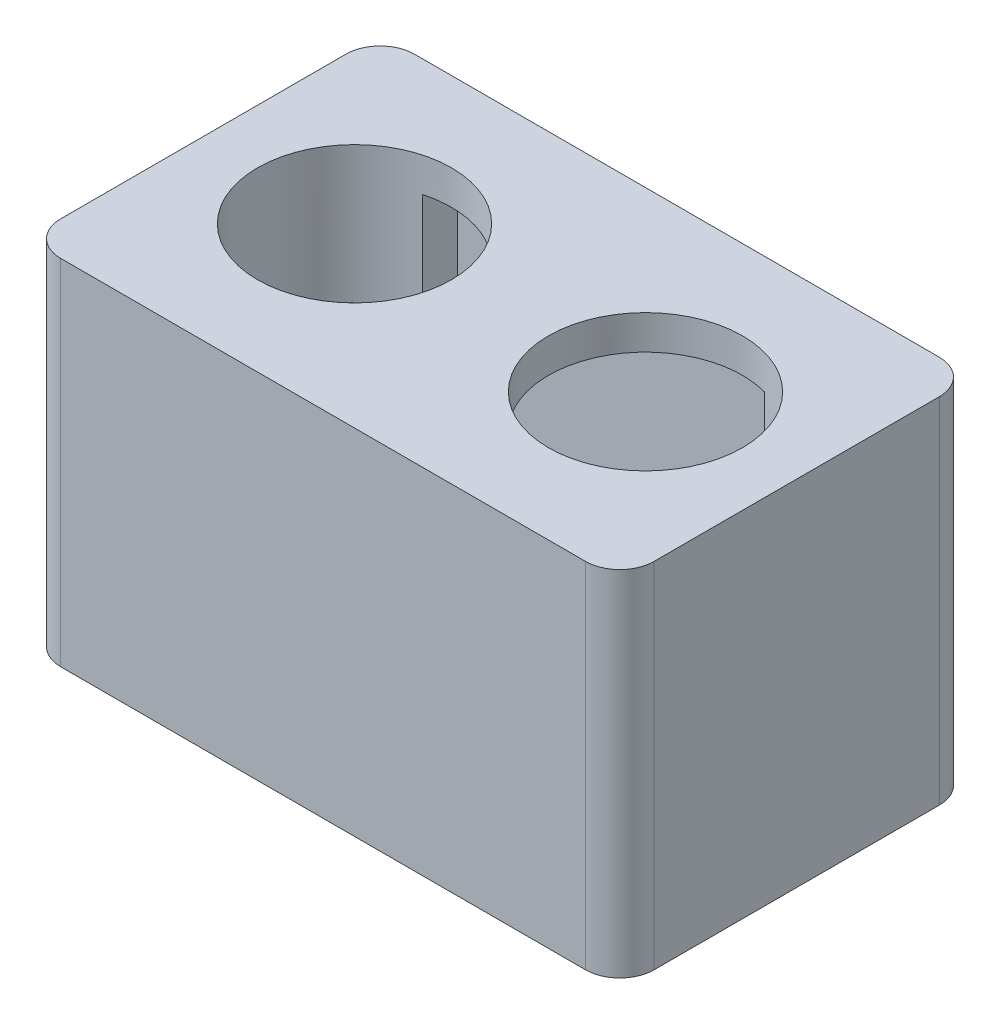
ISO-10303-21;
HEADER;
FILE_DESCRIPTION(('STEP AP214'),'2;1');
FILE_NAME('part.step','',(''),(''),'','','');
FILE_SCHEMA(('AUTOMOTIVE_DESIGN { 1 0 10303 214 1 1 1 1 }'));
ENDSEC;
DATA;
#1=APPLICATION_CONTEXT('core data for automotive mechanical design processes');
#2=APPLICATION_PROTOCOL_DEFINITION('international standard','automotive_design',2000,#1);
#3=PRODUCT_CONTEXT('',#1,'mechanical');
#4=PRODUCT('Part','Part','',(#3));
#5=PRODUCT_RELATED_PRODUCT_CATEGORY('part','',(#4));
#6=PRODUCT_DEFINITION_FORMATION('','',#4);
#7=PRODUCT_DEFINITION_CONTEXT('part definition',#1,'design');
#8=PRODUCT_DEFINITION('design','',#6,#7);
#9=PRODUCT_DEFINITION_SHAPE('','',#8);
#10=(LENGTH_UNIT() NAMED_UNIT(*) SI_UNIT(.MILLI.,.METRE.));
#11=(NAMED_UNIT(*) PLANE_ANGLE_UNIT() SI_UNIT($,.RADIAN.));
#12=(NAMED_UNIT(*) SI_UNIT($,.STERADIAN.) SOLID_ANGLE_UNIT());
#13=UNCERTAINTY_MEASURE_WITH_UNIT(LENGTH_MEASURE(1.E-05),#10,'distance_accuracy_value','');
#14=(GEOMETRIC_REPRESENTATION_CONTEXT(3) GLOBAL_UNCERTAINTY_ASSIGNED_CONTEXT((#13)) GLOBAL_UNIT_ASSIGNED_CONTEXT((#10,
#11,#12)) REPRESENTATION_CONTEXT('',''));
#15=CARTESIAN_POINT('',(0.,0.,0.));
#16=DIRECTION('',(0.,0.,1.));
#17=DIRECTION('',(1.,0.,0.));
#18=AXIS2_PLACEMENT_3D('',#15,#16,#17);
#19=CARTESIAN_POINT('',(12.75,0.,0.));
#20=DIRECTION('',(0.,1.,0.));
#21=DIRECTION('',(0.,0.,1.));
#22=AXIS2_PLACEMENT_3D('',#19,#20,#21);
#23=CYLINDRICAL_SURFACE('',#22,11.5);
#24=DIRECTION('',(0.,1.,0.));
#25=VECTOR('',#24,1.);
#26=CARTESIAN_POINT('',(15.,0.,11.27774356864));
#27=LINE('',#26,#25);
#28=CARTESIAN_POINT('',(15.,19.,11.27774356864));
#29=VERTEX_POINT('',#28);
#30=CARTESIAN_POINT('',(15.,28.,11.27774356864));
#31=VERTEX_POINT('',#30);
#32=EDGE_CURVE('E297',#29,#31,#27,.T.);
#33=ORIENTED_EDGE('',*,*,#32,.F.);
#34=CARTESIAN_POINT('',(12.75,19.,0.));
#35=DIRECTION('',(0.,-1.,0.));
#36=DIRECTION('',(0.,0.,-1.));
#37=AXIS2_PLACEMENT_3D('',#34,#35,#36);
#38=CIRCLE('',#37,11.5);
#39=CARTESIAN_POINT('',(23.,19.,5.21416340365354));
#40=VERTEX_POINT('',#39);
#41=EDGE_CURVE('E530',#29,#40,#38,.F.);
#42=ORIENTED_EDGE('',*,*,#41,.T.);
#43=DIRECTION('',(0.,1.,0.));
#44=VECTOR('',#43,1.);
#45=CARTESIAN_POINT('',(23.,0.,5.21416340365354));
#46=LINE('',#45,#44);
#47=CARTESIAN_POINT('',(23.,28.,5.21416340365354));
#48=VERTEX_POINT('',#47);
#49=EDGE_CURVE('E329',#48,#40,#46,.F.);
#50=ORIENTED_EDGE('',*,*,#49,.F.);
#51=CARTESIAN_POINT('',(12.75,28.,0.));
#52=DIRECTION('',(0.,1.,0.));
#53=DIRECTION('',(0.,0.,1.));
#54=AXIS2_PLACEMENT_3D('',#51,#52,#53);
#55=CIRCLE('',#54,11.5);
#56=EDGE_CURVE('E306',#31,#48,#55,.T.);
#57=ORIENTED_EDGE('',*,*,#56,.F.);
#58=EDGE_LOOP('',(#33,#42,#50,#57));
#59=FACE_BOUND('',#58,.T.);
#60=ADVANCED_FACE('F112',(#59),#23,.T.);
#61=CARTESIAN_POINT('',(-12.75,0.,0.));
#62=DIRECTION('',(0.,1.,0.));
#63=DIRECTION('',(0.,0.,1.));
#64=AXIS2_PLACEMENT_3D('',#61,#62,#63);
#65=CYLINDRICAL_SURFACE('',#64,11.5);
#66=DIRECTION('',(0.,1.,0.));
#67=VECTOR('',#66,1.);
#68=CARTESIAN_POINT('',(-15.,0.,11.27774356864));
#69=LINE('',#68,#67);
#70=CARTESIAN_POINT('',(-15.,28.,11.27774356864));
#71=VERTEX_POINT('',#70);
#72=CARTESIAN_POINT('',(-15.,19.,11.27774356864));
#73=VERTEX_POINT('',#72);
#74=EDGE_CURVE('E458',#71,#73,#69,.F.);
#75=ORIENTED_EDGE('',*,*,#74,.F.);
#76=CARTESIAN_POINT('',(-12.75,28.,0.));
#77=DIRECTION('',(0.,1.,0.));
#78=DIRECTION('',(0.,0.,1.));
#79=AXIS2_PLACEMENT_3D('',#76,#77,#78);
#80=CIRCLE('',#79,11.5);
#81=CARTESIAN_POINT('',(-23.,28.,5.21416340365354));
#82=VERTEX_POINT('',#81);
#83=EDGE_CURVE('E310',#82,#71,#80,.T.);
#84=ORIENTED_EDGE('',*,*,#83,.F.);
#85=DIRECTION('',(0.,1.,0.));
#86=VECTOR('',#85,1.);
#87=CARTESIAN_POINT('',(-23.,0.,5.21416340365354));
#88=LINE('',#87,#86);
#89=CARTESIAN_POINT('',(-23.,19.,5.21416340365354));
#90=VERTEX_POINT('',#89);
#91=EDGE_CURVE('E337',#90,#82,#88,.T.);
#92=ORIENTED_EDGE('',*,*,#91,.F.);
#93=CARTESIAN_POINT('',(-12.75,19.,0.));
#94=DIRECTION('',(0.,-1.,0.));
#95=DIRECTION('',(0.,0.,-1.));
#96=AXIS2_PLACEMENT_3D('',#93,#94,#95);
#97=CIRCLE('',#96,11.5);
#98=EDGE_CURVE('E437',#90,#73,#97,.F.);
#99=ORIENTED_EDGE('',*,*,#98,.T.);
#100=EDGE_LOOP('',(#75,#84,#92,#99));
#101=FACE_BOUND('',#100,.T.);
#102=ADVANCED_FACE('F506',(#101),#65,.T.);
#103=CARTESIAN_POINT('',(12.75,0.,0.));
#104=DIRECTION('',(0.,1.,0.));
#105=DIRECTION('',(0.,0.,1.));
#106=AXIS2_PLACEMENT_3D('',#103,#104,#105);
#107=CYLINDRICAL_SURFACE('',#106,8.5);
#108=CARTESIAN_POINT('',(12.75,31.,0.));
#109=DIRECTION('',(0.,1.,0.));
#110=DIRECTION('',(0.,0.,1.));
#111=AXIS2_PLACEMENT_3D('',#108,#109,#110);
#112=CIRCLE('',#111,8.5);
#113=CARTESIAN_POINT('',(12.75,31.,8.5));
#114=VERTEX_POINT('',#113);
#115=EDGE_CURVE('E344',#114,#114,#112,.T.);
#116=ORIENTED_EDGE('',*,*,#115,.T.);
#117=EDGE_LOOP('',(#116));
#118=FACE_BOUND('',#117,.T.);
#119=CARTESIAN_POINT('',(12.75,28.,0.));
#120=DIRECTION('',(0.,1.,0.));
#121=DIRECTION('',(0.,0.,1.));
#122=AXIS2_PLACEMENT_3D('',#119,#120,#121);
#123=CIRCLE('',#122,8.5);
#124=CARTESIAN_POINT('',(15.,28.,8.1967981553775));
#125=VERTEX_POINT('',#124);
#126=CARTESIAN_POINT('',(15.,28.,-8.1967981553775));
#127=VERTEX_POINT('',#126);
#128=EDGE_CURVE('E521',#125,#127,#123,.F.);
#129=ORIENTED_EDGE('',*,*,#128,.T.);
#130=DIRECTION('',(0.,1.,0.));
#131=VECTOR('',#130,1.);
#132=CARTESIAN_POINT('',(15.,0.,-8.1967981553775));
#133=LINE('',#132,#131);
#134=CARTESIAN_POINT('',(15.,19.,-8.1967981553775));
#135=VERTEX_POINT('',#134);
#136=EDGE_CURVE('E280',#127,#135,#133,.F.);
#137=ORIENTED_EDGE('',*,*,#136,.T.);
#138=CARTESIAN_POINT('',(12.75,19.,0.));
#139=DIRECTION('',(0.,-1.,0.));
#140=DIRECTION('',(0.,0.,-1.));
#141=AXIS2_PLACEMENT_3D('',#138,#139,#140);
#142=CIRCLE('',#141,8.5);
#143=CARTESIAN_POINT('',(15.,19.,8.1967981553775));
#144=VERTEX_POINT('',#143);
#145=EDGE_CURVE('E312',#144,#135,#142,.F.);
#146=ORIENTED_EDGE('',*,*,#145,.F.);
#147=DIRECTION('',(0.,1.,0.));
#148=VECTOR('',#147,1.);
#149=CARTESIAN_POINT('',(15.,0.,8.1967981553775));
#150=LINE('',#149,#148);
#151=EDGE_CURVE('E136',#144,#125,#150,.T.);
#152=ORIENTED_EDGE('',*,*,#151,.T.);
#153=EDGE_LOOP('',(#129,#137,#146,#152));
#154=FACE_BOUND('',#153,.T.);
#155=ADVANCED_FACE('F543',(#118,#154),#107,.F.);
#156=CARTESIAN_POINT('',(-12.75,0.,0.));
#157=DIRECTION('',(0.,1.,0.));
#158=DIRECTION('',(0.,0.,1.));
#159=AXIS2_PLACEMENT_3D('',#156,#157,#158);
#160=CYLINDRICAL_SURFACE('',#159,8.5);
#161=CARTESIAN_POINT('',(-12.75,31.,0.));
#162=DIRECTION('',(0.,1.,0.));
#163=DIRECTION('',(0.,0.,1.));
#164=AXIS2_PLACEMENT_3D('',#161,#162,#163);
#165=CIRCLE('',#164,8.5);
#166=CARTESIAN_POINT('',(-12.75,31.,8.5));
#167=VERTEX_POINT('',#166);
#168=EDGE_CURVE('E345',#167,#167,#165,.T.);
#169=ORIENTED_EDGE('',*,*,#168,.T.);
#170=EDGE_LOOP('',(#169));
#171=FACE_BOUND('',#170,.T.);
#172=CARTESIAN_POINT('',(-12.75,28.,0.));
#173=DIRECTION('',(0.,1.,0.));
#174=DIRECTION('',(0.,0.,1.));
#175=AXIS2_PLACEMENT_3D('',#172,#173,#174);
#176=CIRCLE('',#175,8.5);
#177=CARTESIAN_POINT('',(-15.,28.,-8.1967981553775));
#178=VERTEX_POINT('',#177);
#179=CARTESIAN_POINT('',(-15.,28.,8.1967981553775));
#180=VERTEX_POINT('',#179);
#181=EDGE_CURVE('E518',#178,#180,#176,.F.);
#182=ORIENTED_EDGE('',*,*,#181,.T.);
#183=DIRECTION('',(0.,1.,0.));
#184=VECTOR('',#183,1.);
#185=CARTESIAN_POINT('',(-15.,0.,8.1967981553775));
#186=LINE('',#185,#184);
#187=CARTESIAN_POINT('',(-15.,19.,8.1967981553775));
#188=VERTEX_POINT('',#187);
#189=EDGE_CURVE('E511',#180,#188,#186,.F.);
#190=ORIENTED_EDGE('',*,*,#189,.T.);
#191=CARTESIAN_POINT('',(-12.75,19.,0.));
#192=DIRECTION('',(0.,-1.,0.));
#193=DIRECTION('',(0.,0.,-1.));
#194=AXIS2_PLACEMENT_3D('',#191,#192,#193);
#195=CIRCLE('',#194,8.5);
#196=CARTESIAN_POINT('',(-15.,19.,-8.1967981553775));
#197=VERTEX_POINT('',#196);
#198=EDGE_CURVE('E533',#197,#188,#195,.F.);
#199=ORIENTED_EDGE('',*,*,#198,.F.);
#200=DIRECTION('',(0.,1.,0.));
#201=VECTOR('',#200,1.);
#202=CARTESIAN_POINT('',(-15.,0.,-8.1967981553775));
#203=LINE('',#202,#201);
#204=EDGE_CURVE('E128',#197,#178,#203,.T.);
#205=ORIENTED_EDGE('',*,*,#204,.T.);
#206=EDGE_LOOP('',(#182,#190,#199,#205));
#207=FACE_BOUND('',#206,.T.);
#208=ADVANCED_FACE('F556',(#171,#207),#160,.F.);
#209=DIRECTION('',(0.,1.,0.));
#210=VECTOR('',#209,1.);
#211=CARTESIAN_POINT('',(15.,0.,-11.27774356864));
#212=LINE('',#211,#210);
#213=CARTESIAN_POINT('',(15.,28.,-11.27774356864));
#214=VERTEX_POINT('',#213);
#215=CARTESIAN_POINT('',(15.,19.,-11.27774356864));
#216=VERTEX_POINT('',#215);
#217=EDGE_CURVE('E277',#214,#216,#212,.F.);
#218=ORIENTED_EDGE('',*,*,#217,.F.);
#219=CARTESIAN_POINT('',(23.,28.,-5.21416340365354));
#220=VERTEX_POINT('',#219);
#221=EDGE_CURVE('E293',#220,#214,#55,.T.);
#222=ORIENTED_EDGE('',*,*,#221,.F.);
#223=DIRECTION('',(0.,1.,0.));
#224=VECTOR('',#223,1.);
#225=CARTESIAN_POINT('',(23.,0.,-5.21416340365354));
#226=LINE('',#225,#224);
#227=CARTESIAN_POINT('',(23.,19.,-5.21416340365354));
#228=VERTEX_POINT('',#227);
#229=EDGE_CURVE('E333',#220,#228,#226,.F.);
#230=ORIENTED_EDGE('',*,*,#229,.T.);
#231=EDGE_CURVE('E295',#228,#216,#38,.F.);
#232=ORIENTED_EDGE('',*,*,#231,.T.);
#233=EDGE_LOOP('',(#218,#222,#230,#232));
#234=FACE_BOUND('',#233,.T.);
#235=ADVANCED_FACE('F291',(#234),#23,.T.);
#236=DIRECTION('',(0.,1.,0.));
#237=VECTOR('',#236,1.);
#238=CARTESIAN_POINT('',(-15.,0.,-11.27774356864));
#239=LINE('',#238,#237);
#240=CARTESIAN_POINT('',(-15.,19.,-11.27774356864));
#241=VERTEX_POINT('',#240);
#242=CARTESIAN_POINT('',(-15.,28.,-11.27774356864));
#243=VERTEX_POINT('',#242);
#244=EDGE_CURVE('E448',#241,#243,#239,.T.);
#245=ORIENTED_EDGE('',*,*,#244,.F.);
#246=CARTESIAN_POINT('',(-23.,19.,-5.21416340365354));
#247=VERTEX_POINT('',#246);
#248=EDGE_CURVE('E436',#241,#247,#97,.F.);
#249=ORIENTED_EDGE('',*,*,#248,.T.);
#250=DIRECTION('',(0.,1.,0.));
#251=VECTOR('',#250,1.);
#252=CARTESIAN_POINT('',(-23.,0.,-5.21416340365354));
#253=LINE('',#252,#251);
#254=CARTESIAN_POINT('',(-23.,28.,-5.21416340365354));
#255=VERTEX_POINT('',#254);
#256=EDGE_CURVE('E340',#247,#255,#253,.T.);
#257=ORIENTED_EDGE('',*,*,#256,.T.);
#258=EDGE_CURVE('E305',#243,#255,#80,.T.);
#259=ORIENTED_EDGE('',*,*,#258,.F.);
#260=EDGE_LOOP('',(#245,#249,#257,#259));
#261=FACE_BOUND('',#260,.T.);
#262=ADVANCED_FACE('F455',(#261),#65,.T.);
#263=CARTESIAN_POINT('',(0.,0.,0.));
#264=DIRECTION('',(0.,1.,0.));
#265=DIRECTION('',(0.,0.,1.));
#266=AXIS2_PLACEMENT_3D('',#263,#264,#265);
#267=PLANE('',#266);
#268=DIRECTION('',(1.,0.,0.));
#269=VECTOR('',#268,1.);
#270=CARTESIAN_POINT('',(0.,0.,12.5));
#271=LINE('',#270,#269);
#272=CARTESIAN_POINT('',(-23.,0.,12.5));
#273=VERTEX_POINT('',#272);
#274=CARTESIAN_POINT('',(23.,0.,12.5));
#275=VERTEX_POINT('',#274);
#276=EDGE_CURVE('E323',#273,#275,#271,.T.);
#277=ORIENTED_EDGE('',*,*,#276,.T.);
#278=DIRECTION('',(0.,0.,1.));
#279=VECTOR('',#278,1.);
#280=CARTESIAN_POINT('',(23.,0.,0.));
#281=LINE('',#280,#279);
#282=CARTESIAN_POINT('',(23.,0.,-12.5));
#283=VERTEX_POINT('',#282);
#284=EDGE_CURVE('E320',#283,#275,#281,.T.);
#285=ORIENTED_EDGE('',*,*,#284,.F.);
#286=DIRECTION('',(1.,0.,0.));
#287=VECTOR('',#286,1.);
#288=CARTESIAN_POINT('',(0.,0.,-12.5));
#289=LINE('',#288,#287);
#290=CARTESIAN_POINT('',(-23.,0.,-12.5));
#291=VERTEX_POINT('',#290);
#292=EDGE_CURVE('E315',#291,#283,#289,.T.);
#293=ORIENTED_EDGE('',*,*,#292,.F.);
#294=DIRECTION('',(0.,0.,1.));
#295=VECTOR('',#294,1.);
#296=CARTESIAN_POINT('',(-23.,0.,0.));
#297=LINE('',#296,#295);
#298=EDGE_CURVE('E319',#291,#273,#297,.T.);
#299=ORIENTED_EDGE('',*,*,#298,.T.);
#300=EDGE_LOOP('',(#277,#285,#293,#299));
#301=FACE_BOUND('',#300,.T.);
#302=DIRECTION('',(1.,0.,0.));
#303=VECTOR('',#302,1.);
#304=CARTESIAN_POINT('',(0.,0.,15.5));
#305=LINE('',#304,#303);
#306=CARTESIAN_POINT('',(-23.,0.,15.5));
#307=VERTEX_POINT('',#306);
#308=CARTESIAN_POINT('',(23.,0.,15.5));
#309=VERTEX_POINT('',#308);
#310=EDGE_CURVE('E358',#307,#309,#305,.T.);
#311=ORIENTED_EDGE('',*,*,#310,.F.);
#312=CARTESIAN_POINT('',(-23.,0.,12.5));
#313=DIRECTION('',(0.,1.,0.));
#314=DIRECTION('',(0.,0.,1.));
#315=AXIS2_PLACEMENT_3D('',#312,#313,#314);
#316=CIRCLE('',#315,3.);
#317=CARTESIAN_POINT('',(-26.,0.,12.5));
#318=VERTEX_POINT('',#317);
#319=EDGE_CURVE('E400',#307,#318,#316,.F.);
#320=ORIENTED_EDGE('',*,*,#319,.T.);
#321=DIRECTION('',(0.,0.,1.));
#322=VECTOR('',#321,1.);
#323=CARTESIAN_POINT('',(-26.,0.,0.));
#324=LINE('',#323,#322);
#325=CARTESIAN_POINT('',(-26.,0.,-12.5));
#326=VERTEX_POINT('',#325);
#327=EDGE_CURVE('E378',#326,#318,#324,.T.);
#328=ORIENTED_EDGE('',*,*,#327,.F.);
#329=CARTESIAN_POINT('',(-23.,0.,-12.5));
#330=DIRECTION('',(0.,1.,0.));
#331=DIRECTION('',(0.,0.,1.));
#332=AXIS2_PLACEMENT_3D('',#329,#330,#331);
#333=CIRCLE('',#332,3.);
#334=CARTESIAN_POINT('',(-23.,0.,-15.5));
#335=VERTEX_POINT('',#334);
#336=EDGE_CURVE('E397',#326,#335,#333,.F.);
#337=ORIENTED_EDGE('',*,*,#336,.T.);
#338=DIRECTION('',(1.,0.,0.));
#339=VECTOR('',#338,1.);
#340=CARTESIAN_POINT('',(0.,0.,-15.5));
#341=LINE('',#340,#339);
#342=CARTESIAN_POINT('',(23.,0.,-15.5));
#343=VERTEX_POINT('',#342);
#344=EDGE_CURVE('E374',#335,#343,#341,.T.);
#345=ORIENTED_EDGE('',*,*,#344,.T.);
#346=CARTESIAN_POINT('',(23.,0.,-12.5));
#347=DIRECTION('',(0.,1.,0.));
#348=DIRECTION('',(0.,0.,1.));
#349=AXIS2_PLACEMENT_3D('',#346,#347,#348);
#350=CIRCLE('',#349,3.);
#351=CARTESIAN_POINT('',(26.,0.,-12.5));
#352=VERTEX_POINT('',#351);
#353=EDGE_CURVE('E391',#343,#352,#350,.F.);
#354=ORIENTED_EDGE('',*,*,#353,.T.);
#355=DIRECTION('',(0.,0.,1.));
#356=VECTOR('',#355,1.);
#357=CARTESIAN_POINT('',(26.,0.,0.));
#358=LINE('',#357,#356);
#359=CARTESIAN_POINT('',(26.,0.,12.5));
#360=VERTEX_POINT('',#359);
#361=EDGE_CURVE('E349',#352,#360,#358,.T.);
#362=ORIENTED_EDGE('',*,*,#361,.T.);
#363=CARTESIAN_POINT('',(23.,0.,12.5));
#364=DIRECTION('',(0.,1.,0.));
#365=DIRECTION('',(0.,0.,1.));
#366=AXIS2_PLACEMENT_3D('',#363,#364,#365);
#367=CIRCLE('',#366,3.);
#368=EDGE_CURVE('E394',#360,#309,#367,.F.);
#369=ORIENTED_EDGE('',*,*,#368,.T.);
#370=EDGE_LOOP('',(#311,#320,#328,#337,#345,#354,#362,#369));
#371=FACE_BOUND('',#370,.T.);
#372=ADVANCED_FACE('F579',(#301,#371),#267,.F.);
#373=CARTESIAN_POINT('',(0.,31.,-15.5));
#374=DIRECTION('',(0.,0.,-1.));
#375=DIRECTION('',(-1.,0.,0.));
#376=AXIS2_PLACEMENT_3D('',#373,#374,#375);
#377=PLANE('',#376);
#378=ORIENTED_EDGE('',*,*,#344,.F.);
#379=DIRECTION('',(0.,-1.,0.));
#380=VECTOR('',#379,1.);
#381=CARTESIAN_POINT('',(-23.,31.,-15.5));
#382=LINE('',#381,#380);
#383=CARTESIAN_POINT('',(-23.,31.,-15.5));
#384=VERTEX_POINT('',#383);
#385=EDGE_CURVE('E426',#335,#384,#382,.F.);
#386=ORIENTED_EDGE('',*,*,#385,.T.);
#387=DIRECTION('',(1.,0.,0.));
#388=VECTOR('',#387,1.);
#389=CARTESIAN_POINT('',(0.,31.,-15.5));
#390=LINE('',#389,#388);
#391=CARTESIAN_POINT('',(23.,31.,-15.5));
#392=VERTEX_POINT('',#391);
#393=EDGE_CURVE('E357',#384,#392,#390,.T.);
#394=ORIENTED_EDGE('',*,*,#393,.T.);
#395=DIRECTION('',(0.,-1.,0.));
#396=VECTOR('',#395,1.);
#397=CARTESIAN_POINT('',(23.,31.,-15.5));
#398=LINE('',#397,#396);
#399=EDGE_CURVE('E422',#392,#343,#398,.T.);
#400=ORIENTED_EDGE('',*,*,#399,.T.);
#401=EDGE_LOOP('',(#378,#386,#394,#400));
#402=FACE_BOUND('',#401,.T.);
#403=ADVANCED_FACE('F596',(#402),#377,.T.);
#404=CARTESIAN_POINT('',(-26.,31.,0.));
#405=DIRECTION('',(1.,0.,0.));
#406=DIRECTION('',(0.,0.,-1.));
#407=AXIS2_PLACEMENT_3D('',#404,#405,#406);
#408=PLANE('',#407);
#409=ORIENTED_EDGE('',*,*,#327,.T.);
#410=DIRECTION('',(0.,-1.,0.));
#411=VECTOR('',#410,1.);
#412=CARTESIAN_POINT('',(-26.,31.,12.5));
#413=LINE('',#412,#411);
#414=CARTESIAN_POINT('',(-26.,31.,12.5));
#415=VERTEX_POINT('',#414);
#416=EDGE_CURVE('E407',#318,#415,#413,.F.);
#417=ORIENTED_EDGE('',*,*,#416,.T.);
#418=DIRECTION('',(0.,0.,1.));
#419=VECTOR('',#418,1.);
#420=CARTESIAN_POINT('',(-26.,31.,0.));
#421=LINE('',#420,#419);
#422=CARTESIAN_POINT('',(-26.,31.,-12.5));
#423=VERTEX_POINT('',#422);
#424=EDGE_CURVE('E362',#423,#415,#421,.T.);
#425=ORIENTED_EDGE('',*,*,#424,.F.);
#426=DIRECTION('',(0.,-1.,0.));
#427=VECTOR('',#426,1.);
#428=CARTESIAN_POINT('',(-26.,0.,-12.5));
#429=LINE('',#428,#427);
#430=EDGE_CURVE('E403',#423,#326,#429,.T.);
#431=ORIENTED_EDGE('',*,*,#430,.T.);
#432=EDGE_LOOP('',(#409,#417,#425,#431));
#433=FACE_BOUND('',#432,.T.);
#434=ADVANCED_FACE('F601',(#433),#408,.F.);
#435=CARTESIAN_POINT('',(0.,31.,15.5));
#436=DIRECTION('',(0.,0.,-1.));
#437=DIRECTION('',(-1.,0.,0.));
#438=AXIS2_PLACEMENT_3D('',#435,#436,#437);
#439=PLANE('',#438);
#440=DIRECTION('',(1.,0.,0.));
#441=VECTOR('',#440,1.);
#442=CARTESIAN_POINT('',(0.,31.,15.5));
#443=LINE('',#442,#441);
#444=CARTESIAN_POINT('',(-23.,31.,15.5));
#445=VERTEX_POINT('',#444);
#446=CARTESIAN_POINT('',(23.,31.,15.5));
#447=VERTEX_POINT('',#446);
#448=EDGE_CURVE('E366',#445,#447,#443,.T.);
#449=ORIENTED_EDGE('',*,*,#448,.F.);
#450=DIRECTION('',(0.,-1.,0.));
#451=VECTOR('',#450,1.);
#452=CARTESIAN_POINT('',(-23.,31.,15.5));
#453=LINE('',#452,#451);
#454=EDGE_CURVE('E387',#445,#307,#453,.T.);
#455=ORIENTED_EDGE('',*,*,#454,.T.);
#456=ORIENTED_EDGE('',*,*,#310,.T.);
#457=DIRECTION('',(0.,-1.,0.));
#458=VECTOR('',#457,1.);
#459=CARTESIAN_POINT('',(23.,31.,15.5));
#460=LINE('',#459,#458);
#461=EDGE_CURVE('E370',#309,#447,#460,.F.);
#462=ORIENTED_EDGE('',*,*,#461,.T.);
#463=EDGE_LOOP('',(#449,#455,#456,#462));
#464=FACE_BOUND('',#463,.T.);
#465=ADVANCED_FACE('F598',(#464),#439,.F.);
#466=CARTESIAN_POINT('',(26.,31.,0.));
#467=DIRECTION('',(1.,0.,0.));
#468=DIRECTION('',(0.,0.,-1.));
#469=AXIS2_PLACEMENT_3D('',#466,#467,#468);
#470=PLANE('',#469);
#471=DIRECTION('',(0.,0.,1.));
#472=VECTOR('',#471,1.);
#473=CARTESIAN_POINT('',(26.,31.,0.));
#474=LINE('',#473,#472);
#475=CARTESIAN_POINT('',(26.,31.,-12.5));
#476=VERTEX_POINT('',#475);
#477=CARTESIAN_POINT('',(26.,31.,12.5));
#478=VERTEX_POINT('',#477);
#479=EDGE_CURVE('E353',#476,#478,#474,.T.);
#480=ORIENTED_EDGE('',*,*,#479,.T.);
#481=DIRECTION('',(0.,-1.,0.));
#482=VECTOR('',#481,1.);
#483=CARTESIAN_POINT('',(26.,0.,12.5));
#484=LINE('',#483,#482);
#485=EDGE_CURVE('E432',#478,#360,#484,.T.);
#486=ORIENTED_EDGE('',*,*,#485,.T.);
#487=ORIENTED_EDGE('',*,*,#361,.F.);
#488=DIRECTION('',(0.,-1.,0.));
#489=VECTOR('',#488,1.);
#490=CARTESIAN_POINT('',(26.,31.,-12.5));
#491=LINE('',#490,#489);
#492=EDGE_CURVE('E429',#352,#476,#491,.F.);
#493=ORIENTED_EDGE('',*,*,#492,.T.);
#494=EDGE_LOOP('',(#480,#486,#487,#493));
#495=FACE_BOUND('',#494,.T.);
#496=ADVANCED_FACE('F592',(#495),#470,.T.);
#497=CARTESIAN_POINT('',(0.,31.,0.));
#498=DIRECTION('',(0.,1.,0.));
#499=DIRECTION('',(0.,0.,1.));
#500=AXIS2_PLACEMENT_3D('',#497,#498,#499);
#501=PLANE('',#500);
#502=ORIENTED_EDGE('',*,*,#168,.F.);
#503=EDGE_LOOP('',(#502));
#504=FACE_BOUND('',#503,.T.);
#505=ORIENTED_EDGE('',*,*,#115,.F.);
#506=EDGE_LOOP('',(#505));
#507=FACE_BOUND('',#506,.T.);
#508=ORIENTED_EDGE('',*,*,#424,.T.);
#509=CARTESIAN_POINT('',(-23.,31.,12.5));
#510=DIRECTION('',(0.,1.,0.));
#511=DIRECTION('',(0.,0.,1.));
#512=AXIS2_PLACEMENT_3D('',#509,#510,#511);
#513=CIRCLE('',#512,3.);
#514=EDGE_CURVE('E419',#415,#445,#513,.T.);
#515=ORIENTED_EDGE('',*,*,#514,.T.);
#516=ORIENTED_EDGE('',*,*,#448,.T.);
#517=CARTESIAN_POINT('',(23.,31.,12.5));
#518=DIRECTION('',(0.,1.,0.));
#519=DIRECTION('',(0.,0.,1.));
#520=AXIS2_PLACEMENT_3D('',#517,#518,#519);
#521=CIRCLE('',#520,3.);
#522=EDGE_CURVE('E413',#447,#478,#521,.T.);
#523=ORIENTED_EDGE('',*,*,#522,.T.);
#524=ORIENTED_EDGE('',*,*,#479,.F.);
#525=CARTESIAN_POINT('',(23.,31.,-12.5));
#526=DIRECTION('',(0.,1.,0.));
#527=DIRECTION('',(0.,0.,1.));
#528=AXIS2_PLACEMENT_3D('',#525,#526,#527);
#529=CIRCLE('',#528,3.);
#530=EDGE_CURVE('E410',#476,#392,#529,.T.);
#531=ORIENTED_EDGE('',*,*,#530,.T.);
#532=ORIENTED_EDGE('',*,*,#393,.F.);
#533=CARTESIAN_POINT('',(-23.,31.,-12.5));
#534=DIRECTION('',(0.,1.,0.));
#535=DIRECTION('',(0.,0.,1.));
#536=AXIS2_PLACEMENT_3D('',#533,#534,#535);
#537=CIRCLE('',#536,3.);
#538=EDGE_CURVE('E416',#384,#423,#537,.T.);
#539=ORIENTED_EDGE('',*,*,#538,.T.);
#540=EDGE_LOOP('',(#508,#515,#516,#523,#524,#531,#532,#539));
#541=FACE_BOUND('',#540,.T.);
#542=ADVANCED_FACE('F580',(#504,#507,#541),#501,.T.);
#543=CARTESIAN_POINT('',(-23.,31.,12.5));
#544=DIRECTION('',(0.,-1.,0.));
#545=DIRECTION('',(0.,0.,-1.));
#546=AXIS2_PLACEMENT_3D('',#543,#544,#545);
#547=CYLINDRICAL_SURFACE('',#546,3.);
#548=ORIENTED_EDGE('',*,*,#514,.F.);
#549=ORIENTED_EDGE('',*,*,#416,.F.);
#550=ORIENTED_EDGE('',*,*,#319,.F.);
#551=ORIENTED_EDGE('',*,*,#454,.F.);
#552=EDGE_LOOP('',(#548,#549,#550,#551));
#553=FACE_BOUND('',#552,.T.);
#554=ADVANCED_FACE('F591',(#553),#547,.T.);
#555=CARTESIAN_POINT('',(-23.,31.,-12.5));
#556=DIRECTION('',(0.,1.,0.));
#557=DIRECTION('',(0.,0.,1.));
#558=AXIS2_PLACEMENT_3D('',#555,#556,#557);
#559=CYLINDRICAL_SURFACE('',#558,3.);
#560=ORIENTED_EDGE('',*,*,#538,.F.);
#561=ORIENTED_EDGE('',*,*,#385,.F.);
#562=ORIENTED_EDGE('',*,*,#336,.F.);
#563=ORIENTED_EDGE('',*,*,#430,.F.);
#564=EDGE_LOOP('',(#560,#561,#562,#563));
#565=FACE_BOUND('',#564,.T.);
#566=ADVANCED_FACE('F614',(#565),#559,.T.);
#567=CARTESIAN_POINT('',(23.,31.,12.5));
#568=DIRECTION('',(0.,1.,0.));
#569=DIRECTION('',(0.,0.,1.));
#570=AXIS2_PLACEMENT_3D('',#567,#568,#569);
#571=CYLINDRICAL_SURFACE('',#570,3.);
#572=ORIENTED_EDGE('',*,*,#522,.F.);
#573=ORIENTED_EDGE('',*,*,#461,.F.);
#574=ORIENTED_EDGE('',*,*,#368,.F.);
#575=ORIENTED_EDGE('',*,*,#485,.F.);
#576=EDGE_LOOP('',(#572,#573,#574,#575));
#577=FACE_BOUND('',#576,.T.);
#578=ADVANCED_FACE('F617',(#577),#571,.T.);
#579=CARTESIAN_POINT('',(23.,31.,-12.5));
#580=DIRECTION('',(0.,-1.,0.));
#581=DIRECTION('',(0.,0.,-1.));
#582=AXIS2_PLACEMENT_3D('',#579,#580,#581);
#583=CYLINDRICAL_SURFACE('',#582,3.);
#584=ORIENTED_EDGE('',*,*,#530,.F.);
#585=ORIENTED_EDGE('',*,*,#492,.F.);
#586=ORIENTED_EDGE('',*,*,#353,.F.);
#587=ORIENTED_EDGE('',*,*,#399,.F.);
#588=EDGE_LOOP('',(#584,#585,#586,#587));
#589=FACE_BOUND('',#588,.T.);
#590=ADVANCED_FACE('F114',(#589),#583,.T.);
#591=CARTESIAN_POINT('',(-23.,31.,0.));
#592=DIRECTION('',(1.,0.,0.));
#593=DIRECTION('',(0.,0.,-1.));
#594=AXIS2_PLACEMENT_3D('',#591,#592,#593);
#595=PLANE('',#594);
#596=DIRECTION('',(0.,1.,0.));
#597=VECTOR('',#596,1.);
#598=CARTESIAN_POINT('',(-23.,31.,-12.5));
#599=LINE('',#598,#597);
#600=CARTESIAN_POINT('',(-23.,28.,-12.5));
#601=VERTEX_POINT('',#600);
#602=EDGE_CURVE('E468',#291,#601,#599,.T.);
#603=ORIENTED_EDGE('',*,*,#602,.T.);
#604=DIRECTION('',(0.,0.,1.));
#605=VECTOR('',#604,1.);
#606=CARTESIAN_POINT('',(-23.,28.,0.));
#607=LINE('',#606,#605);
#608=EDGE_CURVE('E481',#601,#255,#607,.T.);
#609=ORIENTED_EDGE('',*,*,#608,.T.);
#610=ORIENTED_EDGE('',*,*,#256,.F.);
#611=DIRECTION('',(0.,0.,-1.));
#612=VECTOR('',#611,1.);
#613=CARTESIAN_POINT('',(-23.,19.,-12.5));
#614=LINE('',#613,#612);
#615=EDGE_CURVE('E463',#90,#247,#614,.T.);
#616=ORIENTED_EDGE('',*,*,#615,.F.);
#617=ORIENTED_EDGE('',*,*,#91,.T.);
#618=CARTESIAN_POINT('',(-23.,28.,12.5));
#619=VERTEX_POINT('',#618);
#620=EDGE_CURVE('E485',#82,#619,#607,.T.);
#621=ORIENTED_EDGE('',*,*,#620,.T.);
#622=DIRECTION('',(0.,1.,0.));
#623=VECTOR('',#622,1.);
#624=CARTESIAN_POINT('',(-23.,31.,12.5));
#625=LINE('',#624,#623);
#626=EDGE_CURVE('E471',#273,#619,#625,.T.);
#627=ORIENTED_EDGE('',*,*,#626,.F.);
#628=ORIENTED_EDGE('',*,*,#298,.F.);
#629=EDGE_LOOP('',(#603,#609,#610,#616,#617,#621,#627,#628));
#630=FACE_BOUND('',#629,.T.);
#631=ADVANCED_FACE('F624',(#630),#595,.T.);
#632=CARTESIAN_POINT('',(23.,31.,0.));
#633=DIRECTION('',(1.,0.,0.));
#634=DIRECTION('',(0.,0.,-1.));
#635=AXIS2_PLACEMENT_3D('',#632,#633,#634);
#636=PLANE('',#635);
#637=ORIENTED_EDGE('',*,*,#284,.T.);
#638=DIRECTION('',(0.,1.,0.));
#639=VECTOR('',#638,1.);
#640=CARTESIAN_POINT('',(23.,31.,12.5));
#641=LINE('',#640,#639);
#642=CARTESIAN_POINT('',(23.,28.,12.5));
#643=VERTEX_POINT('',#642);
#644=EDGE_CURVE('E474',#275,#643,#641,.T.);
#645=ORIENTED_EDGE('',*,*,#644,.T.);
#646=DIRECTION('',(0.,0.,1.));
#647=VECTOR('',#646,1.);
#648=CARTESIAN_POINT('',(23.,28.,0.));
#649=LINE('',#648,#647);
#650=EDGE_CURVE('E491',#48,#643,#649,.T.);
#651=ORIENTED_EDGE('',*,*,#650,.F.);
#652=ORIENTED_EDGE('',*,*,#49,.T.);
#653=DIRECTION('',(0.,0.,1.));
#654=VECTOR('',#653,1.);
#655=CARTESIAN_POINT('',(23.,19.,-12.5));
#656=LINE('',#655,#654);
#657=EDGE_CURVE('E524',#228,#40,#656,.T.);
#658=ORIENTED_EDGE('',*,*,#657,.F.);
#659=ORIENTED_EDGE('',*,*,#229,.F.);
#660=CARTESIAN_POINT('',(23.,28.,-12.5));
#661=VERTEX_POINT('',#660);
#662=EDGE_CURVE('E303',#661,#220,#649,.T.);
#663=ORIENTED_EDGE('',*,*,#662,.F.);
#664=DIRECTION('',(0.,1.,0.));
#665=VECTOR('',#664,1.);
#666=CARTESIAN_POINT('',(23.,31.,-12.5));
#667=LINE('',#666,#665);
#668=EDGE_CURVE('E334',#283,#661,#667,.T.);
#669=ORIENTED_EDGE('',*,*,#668,.F.);
#670=EDGE_LOOP('',(#637,#645,#651,#652,#658,#659,#663,#669));
#671=FACE_BOUND('',#670,.T.);
#672=ADVANCED_FACE('F651',(#671),#636,.F.);
#673=CARTESIAN_POINT('',(0.,31.,-12.5));
#674=DIRECTION('',(0.,0.,-1.));
#675=DIRECTION('',(-1.,0.,0.));
#676=AXIS2_PLACEMENT_3D('',#673,#674,#675);
#677=PLANE('',#676);
#678=ORIENTED_EDGE('',*,*,#668,.T.);
#679=DIRECTION('',(1.,0.,0.));
#680=VECTOR('',#679,1.);
#681=CARTESIAN_POINT('',(0.,28.,-12.5));
#682=LINE('',#681,#680);
#683=EDGE_CURVE('E489',#601,#661,#682,.T.);
#684=ORIENTED_EDGE('',*,*,#683,.F.);
#685=ORIENTED_EDGE('',*,*,#602,.F.);
#686=ORIENTED_EDGE('',*,*,#292,.T.);
#687=EDGE_LOOP('',(#678,#684,#685,#686));
#688=FACE_BOUND('',#687,.T.);
#689=ADVANCED_FACE('F657',(#688),#677,.F.);
#690=CARTESIAN_POINT('',(0.,31.,12.5));
#691=DIRECTION('',(0.,0.,-1.));
#692=DIRECTION('',(-1.,0.,0.));
#693=AXIS2_PLACEMENT_3D('',#690,#691,#692);
#694=PLANE('',#693);
#695=ORIENTED_EDGE('',*,*,#626,.T.);
#696=DIRECTION('',(1.,0.,0.));
#697=VECTOR('',#696,1.);
#698=CARTESIAN_POINT('',(0.,28.,12.5));
#699=LINE('',#698,#697);
#700=EDGE_CURVE('E477',#619,#643,#699,.T.);
#701=ORIENTED_EDGE('',*,*,#700,.T.);
#702=ORIENTED_EDGE('',*,*,#644,.F.);
#703=ORIENTED_EDGE('',*,*,#276,.F.);
#704=EDGE_LOOP('',(#695,#701,#702,#703));
#705=FACE_BOUND('',#704,.T.);
#706=ADVANCED_FACE('F663',(#705),#694,.T.);
#707=CARTESIAN_POINT('',(0.,28.,0.));
#708=DIRECTION('',(0.,1.,0.));
#709=DIRECTION('',(0.,0.,1.));
#710=AXIS2_PLACEMENT_3D('',#707,#708,#709);
#711=PLANE('',#710);
#712=DIRECTION('',(0.,0.,-1.));
#713=VECTOR('',#712,1.);
#714=CARTESIAN_POINT('',(-15.,28.,11.5));
#715=LINE('',#714,#713);
#716=EDGE_CURVE('E285',#178,#243,#715,.T.);
#717=ORIENTED_EDGE('',*,*,#716,.T.);
#718=ORIENTED_EDGE('',*,*,#258,.T.);
#719=ORIENTED_EDGE('',*,*,#608,.F.);
#720=ORIENTED_EDGE('',*,*,#683,.T.);
#721=ORIENTED_EDGE('',*,*,#662,.T.);
#722=ORIENTED_EDGE('',*,*,#221,.T.);
#723=DIRECTION('',(0.,0.,1.));
#724=VECTOR('',#723,1.);
#725=CARTESIAN_POINT('',(15.,28.,11.5));
#726=LINE('',#725,#724);
#727=EDGE_CURVE('E274',#214,#127,#726,.T.);
#728=ORIENTED_EDGE('',*,*,#727,.T.);
#729=ORIENTED_EDGE('',*,*,#128,.F.);
#730=EDGE_CURVE('E286',#125,#31,#726,.T.);
#731=ORIENTED_EDGE('',*,*,#730,.T.);
#732=ORIENTED_EDGE('',*,*,#56,.T.);
#733=ORIENTED_EDGE('',*,*,#650,.T.);
#734=ORIENTED_EDGE('',*,*,#700,.F.);
#735=ORIENTED_EDGE('',*,*,#620,.F.);
#736=ORIENTED_EDGE('',*,*,#83,.T.);
#737=EDGE_CURVE('E500',#71,#180,#715,.T.);
#738=ORIENTED_EDGE('',*,*,#737,.T.);
#739=ORIENTED_EDGE('',*,*,#181,.F.);
#740=EDGE_LOOP('',(#717,#718,#719,#720,#721,#722,#728,#729,#731,#732,#733,#734,#735,#736,#738,#739));
#741=FACE_BOUND('',#740,.T.);
#742=ADVANCED_FACE('F300',(#741),#711,.F.);
#743=CARTESIAN_POINT('',(0.,19.,0.));
#744=DIRECTION('',(0.,-1.,0.));
#745=DIRECTION('',(0.,0.,-1.));
#746=AXIS2_PLACEMENT_3D('',#743,#744,#745);
#747=PLANE('',#746);
#748=DIRECTION('',(0.,0.,-1.));
#749=VECTOR('',#748,1.);
#750=CARTESIAN_POINT('',(-15.,19.,0.));
#751=LINE('',#750,#749);
#752=EDGE_CURVE('E12',#73,#188,#751,.T.);
#753=ORIENTED_EDGE('',*,*,#752,.F.);
#754=ORIENTED_EDGE('',*,*,#98,.F.);
#755=ORIENTED_EDGE('',*,*,#615,.T.);
#756=ORIENTED_EDGE('',*,*,#248,.F.);
#757=EDGE_CURVE('E116',#197,#241,#751,.T.);
#758=ORIENTED_EDGE('',*,*,#757,.F.);
#759=ORIENTED_EDGE('',*,*,#198,.T.);
#760=EDGE_LOOP('',(#753,#754,#755,#756,#758,#759));
#761=FACE_BOUND('',#760,.T.);
#762=ADVANCED_FACE('F461',(#761),#747,.T.);
#763=DIRECTION('',(0.,0.,1.));
#764=VECTOR('',#763,1.);
#765=CARTESIAN_POINT('',(15.,19.,0.));
#766=LINE('',#765,#764);
#767=EDGE_CURVE('E442',#216,#135,#766,.T.);
#768=ORIENTED_EDGE('',*,*,#767,.F.);
#769=ORIENTED_EDGE('',*,*,#231,.F.);
#770=ORIENTED_EDGE('',*,*,#657,.T.);
#771=ORIENTED_EDGE('',*,*,#41,.F.);
#772=EDGE_CURVE('E440',#144,#29,#766,.T.);
#773=ORIENTED_EDGE('',*,*,#772,.F.);
#774=ORIENTED_EDGE('',*,*,#145,.T.);
#775=EDGE_LOOP('',(#768,#769,#770,#771,#773,#774));
#776=FACE_BOUND('',#775,.T.);
#777=ADVANCED_FACE('F540',(#776),#747,.T.);
#778=CARTESIAN_POINT('',(15.,65.8021163428716,11.5));
#779=DIRECTION('',(1.,0.,0.));
#780=DIRECTION('',(0.,0.,-1.));
#781=AXIS2_PLACEMENT_3D('',#778,#779,#780);
#782=PLANE('',#781);
#783=ORIENTED_EDGE('',*,*,#727,.F.);
#784=ORIENTED_EDGE('',*,*,#217,.T.);
#785=ORIENTED_EDGE('',*,*,#767,.T.);
#786=ORIENTED_EDGE('',*,*,#136,.F.);
#787=EDGE_LOOP('',(#783,#784,#785,#786));
#788=FACE_BOUND('',#787,.T.);
#789=ADVANCED_FACE('F276',(#788),#782,.F.);
#790=ORIENTED_EDGE('',*,*,#772,.T.);
#791=ORIENTED_EDGE('',*,*,#32,.T.);
#792=ORIENTED_EDGE('',*,*,#730,.F.);
#793=ORIENTED_EDGE('',*,*,#151,.F.);
#794=EDGE_LOOP('',(#790,#791,#792,#793));
#795=FACE_BOUND('',#794,.T.);
#796=ADVANCED_FACE('F559',(#795),#782,.F.);
#797=CARTESIAN_POINT('',(-15.,65.8021163428716,11.5));
#798=DIRECTION('',(-1.,0.,0.));
#799=DIRECTION('',(0.,0.,1.));
#800=AXIS2_PLACEMENT_3D('',#797,#798,#799);
#801=PLANE('',#800);
#802=ORIENTED_EDGE('',*,*,#737,.F.);
#803=ORIENTED_EDGE('',*,*,#74,.T.);
#804=ORIENTED_EDGE('',*,*,#752,.T.);
#805=ORIENTED_EDGE('',*,*,#189,.F.);
#806=EDGE_LOOP('',(#802,#803,#804,#805));
#807=FACE_BOUND('',#806,.T.);
#808=ADVANCED_FACE('F557',(#807),#801,.F.);
#809=ORIENTED_EDGE('',*,*,#757,.T.);
#810=ORIENTED_EDGE('',*,*,#244,.T.);
#811=ORIENTED_EDGE('',*,*,#716,.F.);
#812=ORIENTED_EDGE('',*,*,#204,.F.);
#813=EDGE_LOOP('',(#809,#810,#811,#812));
#814=FACE_BOUND('',#813,.T.);
#815=ADVANCED_FACE('F447',(#814),#801,.F.);
#816=CLOSED_SHELL('',(#60,#102,#155,#208,#235,#262,#372,#403,#434,#465,#496,#542,#554,#566,#578,
#590,#631,#672,#689,#706,#742,#762,#777,#789,#796,#808,#815));
#817=MANIFOLD_SOLID_BREP('B2',#816);
#818=ADVANCED_BREP_SHAPE_REPRESENTATION('',(#18,#817),#14);
#819=SHAPE_DEFINITION_REPRESENTATION(#9,#818);
ENDSEC;
END-ISO-10303-21;
